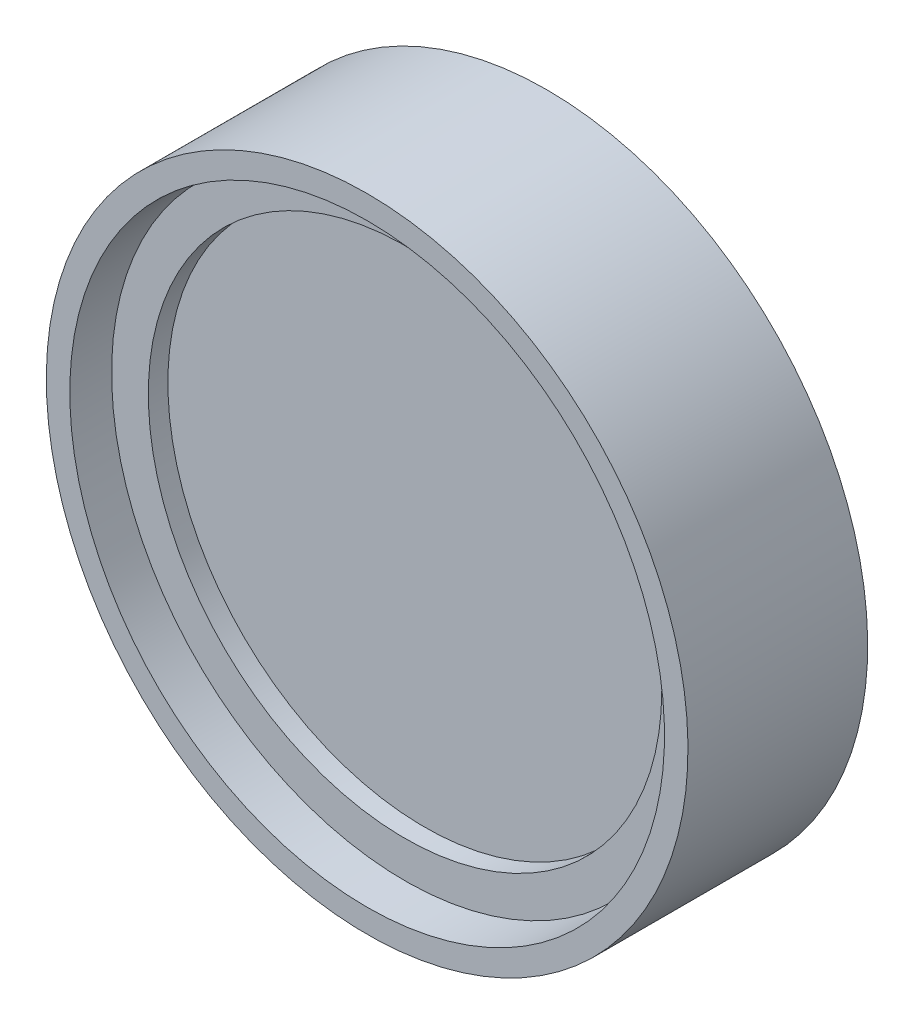
ISO-10303-21;
HEADER;
FILE_DESCRIPTION(('STEP AP214'),'2;1');
FILE_NAME('part.step','',(''),(''),'','','');
FILE_SCHEMA(('AUTOMOTIVE_DESIGN { 1 0 10303 214 1 1 1 1 }'));
ENDSEC;
DATA;
#1=APPLICATION_CONTEXT('core data for automotive mechanical design processes');
#2=APPLICATION_PROTOCOL_DEFINITION('international standard','automotive_design',2000,#1);
#3=PRODUCT_CONTEXT('',#1,'mechanical');
#4=PRODUCT('Part','Part','',(#3));
#5=PRODUCT_RELATED_PRODUCT_CATEGORY('part','',(#4));
#6=PRODUCT_DEFINITION_FORMATION('','',#4);
#7=PRODUCT_DEFINITION_CONTEXT('part definition',#1,'design');
#8=PRODUCT_DEFINITION('design','',#6,#7);
#9=PRODUCT_DEFINITION_SHAPE('','',#8);
#10=(LENGTH_UNIT() NAMED_UNIT(*) SI_UNIT(.MILLI.,.METRE.));
#11=(NAMED_UNIT(*) PLANE_ANGLE_UNIT() SI_UNIT($,.RADIAN.));
#12=(NAMED_UNIT(*) SI_UNIT($,.STERADIAN.) SOLID_ANGLE_UNIT());
#13=UNCERTAINTY_MEASURE_WITH_UNIT(LENGTH_MEASURE(1.E-05),#10,'distance_accuracy_value','');
#14=(GEOMETRIC_REPRESENTATION_CONTEXT(3) GLOBAL_UNCERTAINTY_ASSIGNED_CONTEXT((#13)) GLOBAL_UNIT_ASSIGNED_CONTEXT((#10,
#11,#12)) REPRESENTATION_CONTEXT('',''));
#15=CARTESIAN_POINT('',(0.,0.,0.));
#16=DIRECTION('',(0.,0.,1.));
#17=DIRECTION('',(1.,0.,0.));
#18=AXIS2_PLACEMENT_3D('',#15,#16,#17);
#19=CARTESIAN_POINT('',(0.,0.,2.762));
#20=DIRECTION('',(0.,0.,1.));
#21=DIRECTION('',(1.,0.,0.));
#22=AXIS2_PLACEMENT_3D('',#19,#20,#21);
#23=PLANE('',#22);
#24=CARTESIAN_POINT('',(0.,0.,2.762));
#25=DIRECTION('',(0.,0.,1.));
#26=DIRECTION('',(1.,0.,0.));
#27=AXIS2_PLACEMENT_3D('',#24,#25,#26);
#28=CIRCLE('',#27,5.);
#29=CARTESIAN_POINT('',(5.,0.,2.762));
#30=VERTEX_POINT('',#29);
#31=EDGE_CURVE('P0_E46',#30,#30,#28,.T.);
#32=ORIENTED_EDGE('',*,*,#31,.F.);
#33=EDGE_LOOP('',(#32));
#34=FACE_BOUND('',#33,.T.);
#35=CARTESIAN_POINT('',(0.,0.,2.762));
#36=DIRECTION('',(0.,0.,1.));
#37=DIRECTION('',(1.,0.,0.));
#38=AXIS2_PLACEMENT_3D('',#35,#36,#37);
#39=CIRCLE('',#38,5.715);
#40=CARTESIAN_POINT('',(5.715,0.,2.762));
#41=VERTEX_POINT('',#40);
#42=EDGE_CURVE('P0_E35',#41,#41,#39,.F.);
#43=ORIENTED_EDGE('',*,*,#42,.F.);
#44=EDGE_LOOP('',(#43));
#45=FACE_BOUND('',#44,.T.);
#46=ADVANCED_FACE('P0_F32',(#34,#45),#23,.T.);
#47=CARTESIAN_POINT('',(0.,0.,2.381));
#48=DIRECTION('',(0.,0.,1.));
#49=DIRECTION('',(1.,0.,0.));
#50=AXIS2_PLACEMENT_3D('',#47,#48,#49);
#51=CYLINDRICAL_SURFACE('',#50,5.715);
#52=ORIENTED_EDGE('',*,*,#42,.T.);
#53=EDGE_LOOP('',(#52));
#54=FACE_BOUND('',#53,.T.);
#55=CARTESIAN_POINT('',(0.,0.,2.381));
#56=DIRECTION('',(0.,0.,1.));
#57=DIRECTION('',(1.,0.,0.));
#58=AXIS2_PLACEMENT_3D('',#55,#56,#57);
#59=CIRCLE('',#58,5.715);
#60=CARTESIAN_POINT('',(5.715,0.,2.381));
#61=VERTEX_POINT('',#60);
#62=EDGE_CURVE('P0_E10',#61,#61,#59,.T.);
#63=ORIENTED_EDGE('',*,*,#62,.T.);
#64=EDGE_LOOP('',(#63));
#65=FACE_BOUND('',#64,.T.);
#66=ADVANCED_FACE('P0_F54',(#54,#65),#51,.T.);
#67=CARTESIAN_POINT('',(0.,0.,2.381));
#68=DIRECTION('',(0.,0.,1.));
#69=DIRECTION('',(1.,0.,0.));
#70=AXIS2_PLACEMENT_3D('',#67,#68,#69);
#71=PLANE('',#70);
#72=CARTESIAN_POINT('',(0.,0.,2.381));
#73=DIRECTION('',(0.,0.,1.));
#74=DIRECTION('',(1.,0.,0.));
#75=AXIS2_PLACEMENT_3D('',#72,#73,#74);
#76=CIRCLE('',#75,5.);
#77=CARTESIAN_POINT('',(5.,0.,2.381));
#78=VERTEX_POINT('',#77);
#79=EDGE_CURVE('P0_E42',#78,#78,#76,.F.);
#80=ORIENTED_EDGE('',*,*,#79,.F.);
#81=EDGE_LOOP('',(#80));
#82=FACE_BOUND('',#81,.T.);
#83=ORIENTED_EDGE('',*,*,#62,.F.);
#84=EDGE_LOOP('',(#83));
#85=FACE_BOUND('',#84,.T.);
#86=ADVANCED_FACE('P0_F58',(#82,#85),#71,.F.);
#87=CARTESIAN_POINT('',(0.,0.,-11.7611356237309));
#88=DIRECTION('',(0.,0.,1.));
#89=DIRECTION('',(1.,0.,0.));
#90=AXIS2_PLACEMENT_3D('',#87,#88,#89);
#91=CYLINDRICAL_SURFACE('',#90,5.);
#92=ORIENTED_EDGE('',*,*,#79,.T.);
#93=EDGE_LOOP('',(#92));
#94=FACE_BOUND('',#93,.T.);
#95=ORIENTED_EDGE('',*,*,#31,.T.);
#96=EDGE_LOOP('',(#95));
#97=FACE_BOUND('',#96,.T.);
#98=ADVANCED_FACE('P0_F50',(#94,#97),#91,.F.);
#99=CLOSED_SHELL('',(#46,#66,#86,#98));
#100=MANIFOLD_SOLID_BREP('P0_B2',#99);
#101=CARTESIAN_POINT('',(0.,0.,0.));
#102=DIRECTION('',(0.,0.,-1.));
#103=DIRECTION('',(0.,1.,0.));
#104=AXIS2_PLACEMENT_3D('',#101,#102,#103);
#105=CYLINDRICAL_SURFACE('',#104,5.8547);
#106=CARTESIAN_POINT('',(0.,0.,0.380999999999999));
#107=DIRECTION('',(0.,0.,-1.));
#108=DIRECTION('',(0.,1.,0.));
#109=AXIS2_PLACEMENT_3D('',#106,#107,#108);
#110=CIRCLE('',#109,5.8547);
#111=CARTESIAN_POINT('',(0.,5.8547,0.381));
#112=VERTEX_POINT('',#111);
#113=EDGE_CURVE('P1_E38',#112,#112,#110,.F.);
#114=ORIENTED_EDGE('',*,*,#113,.F.);
#115=EDGE_LOOP('',(#114));
#116=FACE_BOUND('',#115,.T.);
#117=CARTESIAN_POINT('',(0.,0.,0.685799999999999));
#118=DIRECTION('',(0.,0.,-1.));
#119=DIRECTION('',(0.,1.,0.));
#120=AXIS2_PLACEMENT_3D('',#117,#118,#119);
#121=CIRCLE('',#120,5.8547);
#122=CARTESIAN_POINT('',(0.,5.8547,0.6858));
#123=VERTEX_POINT('',#122);
#124=EDGE_CURVE('P1_E16',#123,#123,#121,.T.);
#125=ORIENTED_EDGE('',*,*,#124,.F.);
#126=EDGE_LOOP('',(#125));
#127=FACE_BOUND('',#126,.T.);
#128=ADVANCED_FACE('P1_F13',(#116,#127),#105,.F.);
#129=CARTESIAN_POINT('',(0.,5.7912,0.6858));
#130=DIRECTION('',(0.,0.,-1.));
#131=DIRECTION('',(0.,1.,0.));
#132=AXIS2_PLACEMENT_3D('',#129,#130,#131);
#133=PLANE('',#132);
#134=CARTESIAN_POINT('',(0.,0.,0.685799999999999));
#135=DIRECTION('',(0.,0.,-1.));
#136=DIRECTION('',(0.,1.,0.));
#137=AXIS2_PLACEMENT_3D('',#134,#135,#136);
#138=CIRCLE('',#137,5.7912);
#139=CARTESIAN_POINT('',(0.,5.7912,0.6858));
#140=VERTEX_POINT('',#139);
#141=EDGE_CURVE('P1_E36',#140,#140,#138,.F.);
#142=ORIENTED_EDGE('',*,*,#141,.T.);
#143=EDGE_LOOP('',(#142));
#144=FACE_BOUND('',#143,.T.);
#145=ORIENTED_EDGE('',*,*,#124,.T.);
#146=EDGE_LOOP('',(#145));
#147=FACE_BOUND('',#146,.T.);
#148=ADVANCED_FACE('P1_F45',(#144,#147),#133,.T.);
#149=CARTESIAN_POINT('',(0.,4.3434,0.381));
#150=DIRECTION('',(0.,0.,1.));
#151=DIRECTION('',(0.,-1.,0.));
#152=AXIS2_PLACEMENT_3D('',#149,#150,#151);
#153=PLANE('',#152);
#154=ORIENTED_EDGE('',*,*,#113,.T.);
#155=EDGE_LOOP('',(#154));
#156=FACE_BOUND('',#155,.T.);
#157=CARTESIAN_POINT('',(0.,0.,0.380999999999999));
#158=DIRECTION('',(0.,0.,-1.));
#159=DIRECTION('',(0.,1.,0.));
#160=AXIS2_PLACEMENT_3D('',#157,#158,#159);
#161=CIRCLE('',#160,4.3434);
#162=CARTESIAN_POINT('',(0.,4.3434,0.381));
#163=VERTEX_POINT('',#162);
#164=EDGE_CURVE('P1_E33',#163,#163,#161,.T.);
#165=ORIENTED_EDGE('',*,*,#164,.T.);
#166=EDGE_LOOP('',(#165));
#167=FACE_BOUND('',#166,.T.);
#168=ADVANCED_FACE('P1_F53',(#156,#167),#153,.T.);
#169=CARTESIAN_POINT('',(0.,0.,0.));
#170=DIRECTION('',(0.,0.,-1.));
#171=DIRECTION('',(0.,1.,0.));
#172=AXIS2_PLACEMENT_3D('',#169,#170,#171);
#173=CYLINDRICAL_SURFACE('',#172,5.7912);
#174=ORIENTED_EDGE('',*,*,#141,.F.);
#175=EDGE_LOOP('',(#174));
#176=FACE_BOUND('',#175,.T.);
#177=CARTESIAN_POINT('',(0.,0.,3.5));
#178=DIRECTION('',(0.,0.,-1.));
#179=DIRECTION('',(0.,1.,0.));
#180=AXIS2_PLACEMENT_3D('',#177,#178,#179);
#181=CIRCLE('',#180,5.7912);
#182=CARTESIAN_POINT('',(0.,5.7912,3.5));
#183=VERTEX_POINT('',#182);
#184=EDGE_CURVE('P1_E30',#183,#183,#181,.T.);
#185=ORIENTED_EDGE('',*,*,#184,.F.);
#186=EDGE_LOOP('',(#185));
#187=FACE_BOUND('',#186,.T.);
#188=ADVANCED_FACE('P1_F73',(#176,#187),#173,.F.);
#189=CARTESIAN_POINT('',(0.,0.,0.));
#190=DIRECTION('',(0.,0.,-1.));
#191=DIRECTION('',(0.,1.,0.));
#192=AXIS2_PLACEMENT_3D('',#189,#190,#191);
#193=CYLINDRICAL_SURFACE('',#192,4.3434);
#194=CARTESIAN_POINT('',(0.,0.,0.));
#195=DIRECTION('',(0.,0.,-1.));
#196=DIRECTION('',(0.,1.,0.));
#197=AXIS2_PLACEMENT_3D('',#194,#195,#196);
#198=CIRCLE('',#197,4.3434);
#199=CARTESIAN_POINT('',(0.,4.3434,0.));
#200=VERTEX_POINT('',#199);
#201=EDGE_CURVE('P1_E25',#200,#200,#198,.F.);
#202=ORIENTED_EDGE('',*,*,#201,.F.);
#203=EDGE_LOOP('',(#202));
#204=FACE_BOUND('',#203,.T.);
#205=ORIENTED_EDGE('',*,*,#164,.F.);
#206=EDGE_LOOP('',(#205));
#207=FACE_BOUND('',#206,.T.);
#208=ADVANCED_FACE('P1_F69',(#204,#207),#193,.F.);
#209=CARTESIAN_POINT('',(0.,5.7912,3.5));
#210=DIRECTION('',(0.,0.,1.));
#211=DIRECTION('',(0.,-1.,0.));
#212=AXIS2_PLACEMENT_3D('',#209,#210,#211);
#213=PLANE('',#212);
#214=CARTESIAN_POINT('',(0.,0.,3.5));
#215=DIRECTION('',(0.,0.,-1.));
#216=DIRECTION('',(0.,1.,0.));
#217=AXIS2_PLACEMENT_3D('',#214,#215,#216);
#218=CIRCLE('',#217,6.2484);
#219=CARTESIAN_POINT('',(0.,6.2484,3.5));
#220=VERTEX_POINT('',#219);
#221=EDGE_CURVE('P1_E20',#220,#220,#218,.T.);
#222=ORIENTED_EDGE('',*,*,#221,.F.);
#223=EDGE_LOOP('',(#222));
#224=FACE_BOUND('',#223,.T.);
#225=ORIENTED_EDGE('',*,*,#184,.T.);
#226=EDGE_LOOP('',(#225));
#227=FACE_BOUND('',#226,.T.);
#228=ADVANCED_FACE('P1_F62',(#224,#227),#213,.T.);
#229=CARTESIAN_POINT('',(0.,4.3434,0.));
#230=DIRECTION('',(0.,0.,-1.));
#231=DIRECTION('',(0.,1.,0.));
#232=AXIS2_PLACEMENT_3D('',#229,#230,#231);
#233=PLANE('',#232);
#234=ORIENTED_EDGE('',*,*,#201,.T.);
#235=EDGE_LOOP('',(#234));
#236=FACE_BOUND('',#235,.T.);
#237=CARTESIAN_POINT('',(0.,0.,0.));
#238=DIRECTION('',(0.,0.,-1.));
#239=DIRECTION('',(0.,1.,0.));
#240=AXIS2_PLACEMENT_3D('',#237,#238,#239);
#241=CIRCLE('',#240,6.2484);
#242=CARTESIAN_POINT('',(0.,6.2484,0.));
#243=VERTEX_POINT('',#242);
#244=EDGE_CURVE('P1_E9',#243,#243,#241,.F.);
#245=ORIENTED_EDGE('',*,*,#244,.F.);
#246=EDGE_LOOP('',(#245));
#247=FACE_BOUND('',#246,.T.);
#248=ADVANCED_FACE('P1_F57',(#236,#247),#233,.T.);
#249=CARTESIAN_POINT('',(0.,0.,0.));
#250=DIRECTION('',(0.,0.,-1.));
#251=DIRECTION('',(0.,1.,0.));
#252=AXIS2_PLACEMENT_3D('',#249,#250,#251);
#253=CYLINDRICAL_SURFACE('',#252,6.2484);
#254=ORIENTED_EDGE('',*,*,#244,.T.);
#255=EDGE_LOOP('',(#254));
#256=FACE_BOUND('',#255,.T.);
#257=ORIENTED_EDGE('',*,*,#221,.T.);
#258=EDGE_LOOP('',(#257));
#259=FACE_BOUND('',#258,.T.);
#260=ADVANCED_FACE('P1_F55',(#256,#259),#253,.T.);
#261=CLOSED_SHELL('',(#128,#148,#168,#188,#208,#228,#248,#260));
#262=MANIFOLD_SOLID_BREP('P1_B1',#261);
#263=CARTESIAN_POINT('',(0.,0.,2.381));
#264=DIRECTION('',(0.,0.,1.));
#265=DIRECTION('',(1.,0.,0.));
#266=AXIS2_PLACEMENT_3D('',#263,#264,#265);
#267=PLANE('',#266);
#268=CARTESIAN_POINT('',(0.,0.,2.381));
#269=DIRECTION('',(0.,0.,1.));
#270=DIRECTION('',(1.,0.,0.));
#271=AXIS2_PLACEMENT_3D('',#268,#269,#270);
#272=CIRCLE('',#271,5.7);
#273=CARTESIAN_POINT('',(5.7,0.,2.381));
#274=VERTEX_POINT('',#273);
#275=EDGE_CURVE('P2_E17',#274,#274,#272,.F.);
#276=ORIENTED_EDGE('',*,*,#275,.F.);
#277=EDGE_LOOP('',(#276));
#278=FACE_BOUND('',#277,.T.);
#279=ADVANCED_FACE('P2_F14',(#278),#267,.T.);
#280=CARTESIAN_POINT('',(0.,0.,0.381000000000001));
#281=DIRECTION('',(0.,0.,1.));
#282=DIRECTION('',(1.,0.,0.));
#283=AXIS2_PLACEMENT_3D('',#280,#281,#282);
#284=CYLINDRICAL_SURFACE('',#283,5.7);
#285=ORIENTED_EDGE('',*,*,#275,.T.);
#286=EDGE_LOOP('',(#285));
#287=FACE_BOUND('',#286,.T.);
#288=CARTESIAN_POINT('',(0.,0.,0.381000000000001));
#289=DIRECTION('',(0.,0.,1.));
#290=DIRECTION('',(1.,0.,0.));
#291=AXIS2_PLACEMENT_3D('',#288,#289,#290);
#292=CIRCLE('',#291,5.7);
#293=CARTESIAN_POINT('',(5.7,0.,0.381000000000001));
#294=VERTEX_POINT('',#293);
#295=EDGE_CURVE('P2_E10',#294,#294,#292,.T.);
#296=ORIENTED_EDGE('',*,*,#295,.T.);
#297=EDGE_LOOP('',(#296));
#298=FACE_BOUND('',#297,.T.);
#299=ADVANCED_FACE('P2_F26',(#287,#298),#284,.T.);
#300=CARTESIAN_POINT('',(0.,0.,0.381000000000001));
#301=DIRECTION('',(0.,0.,1.));
#302=DIRECTION('',(1.,0.,0.));
#303=AXIS2_PLACEMENT_3D('',#300,#301,#302);
#304=PLANE('',#303);
#305=ORIENTED_EDGE('',*,*,#295,.F.);
#306=EDGE_LOOP('',(#305));
#307=FACE_BOUND('',#306,.T.);
#308=ADVANCED_FACE('P2_F33',(#307),#304,.F.);
#309=CLOSED_SHELL('',(#279,#299,#308));
#310=MANIFOLD_SOLID_BREP('P2_B1',#309);
#311=ADVANCED_BREP_SHAPE_REPRESENTATION('',(#18,#100,#262,#310),#14);
#312=SHAPE_DEFINITION_REPRESENTATION(#9,#311);
ENDSEC;
END-ISO-10303-21;
